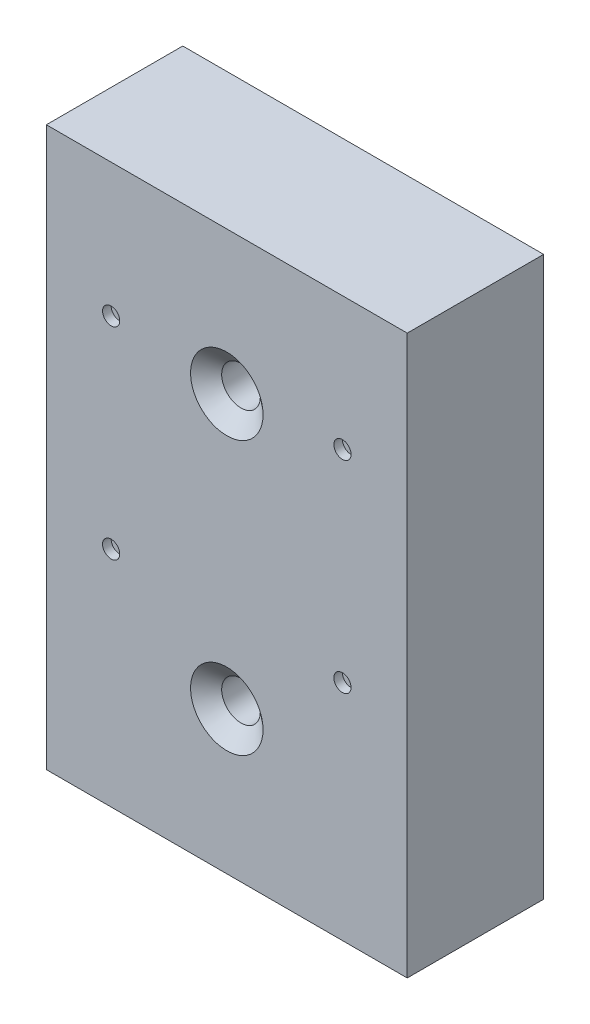
ISO-10303-21;
HEADER;
FILE_DESCRIPTION(('STEP AP214'),'2;1');
FILE_NAME('part.step','',(''),(''),'','','');
FILE_SCHEMA(('AUTOMOTIVE_DESIGN { 1 0 10303 214 1 1 1 1 }'));
ENDSEC;
DATA;
#1=APPLICATION_CONTEXT('core data for automotive mechanical design processes');
#2=APPLICATION_PROTOCOL_DEFINITION('international standard','automotive_design',2000,#1);
#3=PRODUCT_CONTEXT('',#1,'mechanical');
#4=PRODUCT('Part','Part','',(#3));
#5=PRODUCT_RELATED_PRODUCT_CATEGORY('part','',(#4));
#6=PRODUCT_DEFINITION_FORMATION('','',#4);
#7=PRODUCT_DEFINITION_CONTEXT('part definition',#1,'design');
#8=PRODUCT_DEFINITION('design','',#6,#7);
#9=PRODUCT_DEFINITION_SHAPE('','',#8);
#10=(LENGTH_UNIT() NAMED_UNIT(*) SI_UNIT(.MILLI.,.METRE.));
#11=(NAMED_UNIT(*) PLANE_ANGLE_UNIT() SI_UNIT($,.RADIAN.));
#12=(NAMED_UNIT(*) SI_UNIT($,.STERADIAN.) SOLID_ANGLE_UNIT());
#13=UNCERTAINTY_MEASURE_WITH_UNIT(LENGTH_MEASURE(1.E-05),#10,'distance_accuracy_value','');
#14=(GEOMETRIC_REPRESENTATION_CONTEXT(3) GLOBAL_UNCERTAINTY_ASSIGNED_CONTEXT((#13)) GLOBAL_UNIT_ASSIGNED_CONTEXT((#10,
#11,#12)) REPRESENTATION_CONTEXT('',''));
#15=CARTESIAN_POINT('',(0.,0.,0.));
#16=DIRECTION('',(0.,0.,1.));
#17=DIRECTION('',(1.,0.,0.));
#18=AXIS2_PLACEMENT_3D('',#15,#16,#17);
#19=CARTESIAN_POINT('',(21.,32.4999999999999,15.874999999999));
#20=DIRECTION('',(-1.,0.,0.));
#21=DIRECTION('',(0.,-1.,0.));
#22=AXIS2_PLACEMENT_3D('',#19,#20,#21);
#23=PLANE('',#22);
#24=DIRECTION('',(0.,1.,0.));
#25=VECTOR('',#24,1.);
#26=CARTESIAN_POINT('',(21.,32.5,-1.0547118733939E-12));
#27=LINE('',#26,#25);
#28=CARTESIAN_POINT('',(20.9999999999999,-32.5,-2.77555756156289E-13));
#29=VERTEX_POINT('',#28);
#30=CARTESIAN_POINT('',(21.,32.5,-1.0547118733939E-12));
#31=VERTEX_POINT('',#30);
#32=EDGE_CURVE('E100',#29,#31,#27,.T.);
#33=ORIENTED_EDGE('',*,*,#32,.T.);
#34=DIRECTION('',(0.,0.,-1.));
#35=VECTOR('',#34,1.);
#36=CARTESIAN_POINT('',(21.,32.4999999999999,15.874999999999));
#37=LINE('',#36,#35);
#38=CARTESIAN_POINT('',(21.,32.4999999999999,15.874999999999));
#39=VERTEX_POINT('',#38);
#40=EDGE_CURVE('E11',#39,#31,#37,.T.);
#41=ORIENTED_EDGE('',*,*,#40,.F.);
#42=DIRECTION('',(0.,1.,0.));
#43=VECTOR('',#42,1.);
#44=CARTESIAN_POINT('',(21.,32.4999999999999,15.874999999999));
#45=LINE('',#44,#43);
#46=CARTESIAN_POINT('',(20.9999999999999,-32.4999999999996,15.874999999999));
#47=VERTEX_POINT('',#46);
#48=EDGE_CURVE('E87',#47,#39,#45,.T.);
#49=ORIENTED_EDGE('',*,*,#48,.F.);
#50=DIRECTION('',(0.,0.,-1.));
#51=VECTOR('',#50,1.);
#52=CARTESIAN_POINT('',(20.9999999999999,-32.4999999999996,15.874999999999));
#53=LINE('',#52,#51);
#54=EDGE_CURVE('E96',#47,#29,#53,.T.);
#55=ORIENTED_EDGE('',*,*,#54,.T.);
#56=EDGE_LOOP('',(#33,#41,#49,#55));
#57=FACE_BOUND('',#56,.T.);
#58=ADVANCED_FACE('F34',(#57),#23,.F.);
#59=CARTESIAN_POINT('',(-21.,32.4999999999999,15.8749999999994));
#60=DIRECTION('',(0.,-1.,0.));
#61=DIRECTION('',(0.,0.,-1.));
#62=AXIS2_PLACEMENT_3D('',#59,#60,#61);
#63=PLANE('',#62);
#64=DIRECTION('',(-1.,0.,0.));
#65=VECTOR('',#64,1.);
#66=CARTESIAN_POINT('',(-21.,32.4999999999998,-1.0547118733939E-12));
#67=LINE('',#66,#65);
#68=CARTESIAN_POINT('',(-21.,32.4999999999998,-1.0547118733939E-12));
#69=VERTEX_POINT('',#68);
#70=EDGE_CURVE('E91',#31,#69,#67,.T.);
#71=ORIENTED_EDGE('',*,*,#70,.T.);
#72=DIRECTION('',(0.,0.,-1.));
#73=VECTOR('',#72,1.);
#74=CARTESIAN_POINT('',(-21.,32.4999999999999,15.8749999999994));
#75=LINE('',#74,#73);
#76=CARTESIAN_POINT('',(-21.,32.4999999999999,15.8749999999994));
#77=VERTEX_POINT('',#76);
#78=EDGE_CURVE('E43',#77,#69,#75,.T.);
#79=ORIENTED_EDGE('',*,*,#78,.F.);
#80=DIRECTION('',(-1.,0.,0.));
#81=VECTOR('',#80,1.);
#82=CARTESIAN_POINT('',(-21.,32.4999999999999,15.8749999999994));
#83=LINE('',#82,#81);
#84=EDGE_CURVE('E82',#39,#77,#83,.T.);
#85=ORIENTED_EDGE('',*,*,#84,.F.);
#86=ORIENTED_EDGE('',*,*,#40,.T.);
#87=EDGE_LOOP('',(#71,#79,#85,#86));
#88=FACE_BOUND('',#87,.T.);
#89=ADVANCED_FACE('F90',(#88),#63,.F.);
#90=CARTESIAN_POINT('',(-21.,32.4999999999999,15.8749999999994));
#91=DIRECTION('',(1.,0.,0.));
#92=DIRECTION('',(0.,1.,0.));
#93=AXIS2_PLACEMENT_3D('',#90,#91,#92);
#94=PLANE('',#93);
#95=DIRECTION('',(0.,-1.,0.));
#96=VECTOR('',#95,1.);
#97=CARTESIAN_POINT('',(-21.,32.4999999999998,-1.0547118733939E-12));
#98=LINE('',#97,#96);
#99=CARTESIAN_POINT('',(-21.0000000000002,-32.5,-2.77555756156289E-13));
#100=VERTEX_POINT('',#99);
#101=EDGE_CURVE('E69',#69,#100,#98,.T.);
#102=ORIENTED_EDGE('',*,*,#101,.T.);
#103=DIRECTION('',(0.,0.,-1.));
#104=VECTOR('',#103,1.);
#105=CARTESIAN_POINT('',(-21.0000000000002,-32.4999999999996,15.8749999999998));
#106=LINE('',#105,#104);
#107=CARTESIAN_POINT('',(-21.0000000000002,-32.4999999999996,15.8749999999998));
#108=VERTEX_POINT('',#107);
#109=EDGE_CURVE('E92',#108,#100,#106,.T.);
#110=ORIENTED_EDGE('',*,*,#109,.F.);
#111=DIRECTION('',(0.,-1.,0.));
#112=VECTOR('',#111,1.);
#113=CARTESIAN_POINT('',(-21.,32.4999999999999,15.8749999999994));
#114=LINE('',#113,#112);
#115=EDGE_CURVE('E85',#77,#108,#114,.T.);
#116=ORIENTED_EDGE('',*,*,#115,.F.);
#117=ORIENTED_EDGE('',*,*,#78,.T.);
#118=EDGE_LOOP('',(#102,#110,#116,#117));
#119=FACE_BOUND('',#118,.T.);
#120=ADVANCED_FACE('F94',(#119),#94,.F.);
#121=CARTESIAN_POINT('',(-21.0000000000002,-32.4999999999996,15.8749999999998));
#122=DIRECTION('',(0.,1.,0.));
#123=DIRECTION('',(0.,0.,1.));
#124=AXIS2_PLACEMENT_3D('',#121,#122,#123);
#125=PLANE('',#124);
#126=DIRECTION('',(1.,0.,0.));
#127=VECTOR('',#126,1.);
#128=CARTESIAN_POINT('',(-21.0000000000002,-32.5,-2.77555756156289E-13));
#129=LINE('',#128,#127);
#130=EDGE_CURVE('E75',#100,#29,#129,.T.);
#131=ORIENTED_EDGE('',*,*,#130,.T.);
#132=ORIENTED_EDGE('',*,*,#54,.F.);
#133=DIRECTION('',(1.,0.,0.));
#134=VECTOR('',#133,1.);
#135=CARTESIAN_POINT('',(-21.0000000000002,-32.4999999999996,15.8749999999998));
#136=LINE('',#135,#134);
#137=EDGE_CURVE('E52',#108,#47,#136,.T.);
#138=ORIENTED_EDGE('',*,*,#137,.F.);
#139=ORIENTED_EDGE('',*,*,#109,.T.);
#140=EDGE_LOOP('',(#131,#132,#138,#139));
#141=FACE_BOUND('',#140,.T.);
#142=ADVANCED_FACE('F170',(#141),#125,.F.);
#143=CARTESIAN_POINT('',(0.,3.33066907387547E-13,15.8750000000001));
#144=DIRECTION('',(0.,0.,1.));
#145=DIRECTION('',(1.,0.,0.));
#146=AXIS2_PLACEMENT_3D('',#143,#144,#145);
#147=PLANE('',#146);
#148=CARTESIAN_POINT('',(0.,15.8749999999999,15.8749999999992));
#149=DIRECTION('',(0.,0.,1.));
#150=DIRECTION('',(1.,0.,0.));
#151=AXIS2_PLACEMENT_3D('',#148,#149,#150);
#152=CIRCLE('',#151,4.2164);
#153=CARTESIAN_POINT('',(4.21639999999996,15.8749999999999,15.8749999999992));
#154=VERTEX_POINT('',#153);
#155=EDGE_CURVE('E161',#154,#154,#152,.T.);
#156=ORIENTED_EDGE('',*,*,#155,.F.);
#157=EDGE_LOOP('',(#156));
#158=FACE_BOUND('',#157,.T.);
#159=CARTESIAN_POINT('',(0.,-15.8749999999998,15.8750000000001));
#160=DIRECTION('',(0.,0.,1.));
#161=DIRECTION('',(1.,0.,0.));
#162=AXIS2_PLACEMENT_3D('',#159,#160,#161);
#163=CIRCLE('',#162,4.2164);
#164=CARTESIAN_POINT('',(4.21639999999995,-15.8749999999998,15.8750000000001));
#165=VERTEX_POINT('',#164);
#166=EDGE_CURVE('E152',#165,#165,#163,.T.);
#167=ORIENTED_EDGE('',*,*,#166,.F.);
#168=EDGE_LOOP('',(#167));
#169=FACE_BOUND('',#168,.T.);
#170=CARTESIAN_POINT('',(13.4595397764349,-6.49999999999962,15.8749999999997));
#171=DIRECTION('',(0.,0.,1.));
#172=DIRECTION('',(1.,0.,0.));
#173=AXIS2_PLACEMENT_3D('',#170,#171,#172);
#174=CIRCLE('',#173,1.);
#175=CARTESIAN_POINT('',(14.4595397764349,-6.49999999999962,15.8749999999997));
#176=VERTEX_POINT('',#175);
#177=EDGE_CURVE('E37',#176,#176,#174,.F.);
#178=ORIENTED_EDGE('',*,*,#177,.T.);
#179=EDGE_LOOP('',(#178));
#180=FACE_BOUND('',#179,.T.);
#181=CARTESIAN_POINT('',(13.4595397764349,16.9999999999998,15.8749999999995));
#182=DIRECTION('',(0.,0.,1.));
#183=DIRECTION('',(1.,0.,0.));
#184=AXIS2_PLACEMENT_3D('',#181,#182,#183);
#185=CIRCLE('',#184,1.);
#186=CARTESIAN_POINT('',(14.4595397764349,16.9999999999998,15.8749999999995));
#187=VERTEX_POINT('',#186);
#188=EDGE_CURVE('E114',#187,#187,#185,.F.);
#189=ORIENTED_EDGE('',*,*,#188,.T.);
#190=EDGE_LOOP('',(#189));
#191=FACE_BOUND('',#190,.T.);
#192=CARTESIAN_POINT('',(-13.4595397764349,16.9999999999998,15.8749999999995));
#193=DIRECTION('',(0.,0.,1.));
#194=DIRECTION('',(1.,0.,0.));
#195=AXIS2_PLACEMENT_3D('',#192,#193,#194);
#196=CIRCLE('',#195,1.);
#197=CARTESIAN_POINT('',(-12.4595397764349,16.9999999999998,15.8749999999995));
#198=VERTEX_POINT('',#197);
#199=EDGE_CURVE('E111',#198,#198,#196,.F.);
#200=ORIENTED_EDGE('',*,*,#199,.T.);
#201=EDGE_LOOP('',(#200));
#202=FACE_BOUND('',#201,.T.);
#203=CARTESIAN_POINT('',(-13.4595397764349,-6.49999999999962,15.8749999999997));
#204=DIRECTION('',(0.,0.,1.));
#205=DIRECTION('',(1.,0.,0.));
#206=AXIS2_PLACEMENT_3D('',#203,#204,#205);
#207=CIRCLE('',#206,1.);
#208=CARTESIAN_POINT('',(-12.4595397764349,-6.49999999999962,15.8749999999997));
#209=VERTEX_POINT('',#208);
#210=EDGE_CURVE('E108',#209,#209,#207,.F.);
#211=ORIENTED_EDGE('',*,*,#210,.T.);
#212=EDGE_LOOP('',(#211));
#213=FACE_BOUND('',#212,.T.);
#214=ORIENTED_EDGE('',*,*,#48,.T.);
#215=ORIENTED_EDGE('',*,*,#84,.T.);
#216=ORIENTED_EDGE('',*,*,#115,.T.);
#217=ORIENTED_EDGE('',*,*,#137,.T.);
#218=EDGE_LOOP('',(#214,#215,#216,#217));
#219=FACE_BOUND('',#218,.T.);
#220=ADVANCED_FACE('F83',(#158,#169,#180,#191,#202,#213,#219),#147,.T.);
#221=CARTESIAN_POINT('',(0.,0.,0.));
#222=DIRECTION('',(0.,0.,1.));
#223=DIRECTION('',(1.,0.,0.));
#224=AXIS2_PLACEMENT_3D('',#221,#222,#223);
#225=PLANE('',#224);
#226=CARTESIAN_POINT('',(0.,15.8750000000001,-1.11022302462516E-12));
#227=DIRECTION('',(0.,0.,1.));
#228=DIRECTION('',(1.,0.,0.));
#229=AXIS2_PLACEMENT_3D('',#226,#227,#228);
#230=CIRCLE('',#229,2.2479);
#231=CARTESIAN_POINT('',(2.2479,15.8750000000001,-1.11010427458769E-12));
#232=VERTEX_POINT('',#231);
#233=EDGE_CURVE('E155',#232,#232,#230,.T.);
#234=ORIENTED_EDGE('',*,*,#233,.T.);
#235=EDGE_LOOP('',(#234));
#236=FACE_BOUND('',#235,.T.);
#237=CARTESIAN_POINT('',(0.,-15.8750000000001,-2.22044604925031E-13));
#238=DIRECTION('',(0.,0.,1.));
#239=DIRECTION('',(1.,0.,0.));
#240=AXIS2_PLACEMENT_3D('',#237,#238,#239);
#241=CIRCLE('',#240,2.2479);
#242=CARTESIAN_POINT('',(2.24789999999999,-15.8750000000001,-2.21925854887567E-13));
#243=VERTEX_POINT('',#242);
#244=EDGE_CURVE('E133',#243,#243,#241,.T.);
#245=ORIENTED_EDGE('',*,*,#244,.T.);
#246=EDGE_LOOP('',(#245));
#247=FACE_BOUND('',#246,.T.);
#248=ORIENTED_EDGE('',*,*,#32,.F.);
#249=ORIENTED_EDGE('',*,*,#130,.F.);
#250=ORIENTED_EDGE('',*,*,#101,.F.);
#251=ORIENTED_EDGE('',*,*,#70,.F.);
#252=EDGE_LOOP('',(#248,#249,#250,#251));
#253=FACE_BOUND('',#252,.T.);
#254=ADVANCED_FACE('F169',(#236,#247,#253),#225,.F.);
#255=CARTESIAN_POINT('',(-13.4595397764349,-6.49999999999962,15.8750119999996));
#256=DIRECTION('',(0.,0.,-1.));
#257=DIRECTION('',(-1.,0.,0.));
#258=AXIS2_PLACEMENT_3D('',#255,#256,#257);
#259=CYLINDRICAL_SURFACE('',#258,1.);
#260=ORIENTED_EDGE('',*,*,#210,.F.);
#261=EDGE_LOOP('',(#260));
#262=FACE_BOUND('',#261,.T.);
#263=CARTESIAN_POINT('',(-13.4595397764349,-6.49999999999978,14.8749999999996));
#264=DIRECTION('',(0.,0.,1.));
#265=DIRECTION('',(1.,0.,0.));
#266=AXIS2_PLACEMENT_3D('',#263,#264,#265);
#267=CIRCLE('',#266,1.);
#268=CARTESIAN_POINT('',(-12.4595397764349,-6.49999999999978,14.8749999999996));
#269=VERTEX_POINT('',#268);
#270=EDGE_CURVE('E112',#269,#269,#267,.T.);
#271=ORIENTED_EDGE('',*,*,#270,.F.);
#272=EDGE_LOOP('',(#271));
#273=FACE_BOUND('',#272,.T.);
#274=ADVANCED_FACE('F197',(#262,#273),#259,.F.);
#275=CARTESIAN_POINT('',(-13.4595397764349,-6.49999999999978,14.8749999999996));
#276=DIRECTION('',(0.,0.,1.));
#277=DIRECTION('',(1.,0.,0.));
#278=AXIS2_PLACEMENT_3D('',#275,#276,#277);
#279=PLANE('',#278);
#280=ORIENTED_EDGE('',*,*,#270,.T.);
#281=EDGE_LOOP('',(#280));
#282=FACE_BOUND('',#281,.T.);
#283=ADVANCED_FACE('F203',(#282),#279,.T.);
#284=CARTESIAN_POINT('',(-13.4595397764349,16.9999999999998,15.8750119999994));
#285=DIRECTION('',(0.,0.,-1.));
#286=DIRECTION('',(-1.,0.,0.));
#287=AXIS2_PLACEMENT_3D('',#284,#285,#286);
#288=CYLINDRICAL_SURFACE('',#287,1.);
#289=ORIENTED_EDGE('',*,*,#199,.F.);
#290=EDGE_LOOP('',(#289));
#291=FACE_BOUND('',#290,.T.);
#292=CARTESIAN_POINT('',(-13.4595397764349,16.9999999999999,14.8749999999994));
#293=DIRECTION('',(0.,0.,1.));
#294=DIRECTION('',(1.,0.,0.));
#295=AXIS2_PLACEMENT_3D('',#292,#293,#294);
#296=CIRCLE('',#295,1.);
#297=CARTESIAN_POINT('',(-12.4595397764349,16.9999999999999,14.8749999999994));
#298=VERTEX_POINT('',#297);
#299=EDGE_CURVE('E136',#298,#298,#296,.T.);
#300=ORIENTED_EDGE('',*,*,#299,.F.);
#301=EDGE_LOOP('',(#300));
#302=FACE_BOUND('',#301,.T.);
#303=ADVANCED_FACE('F242',(#291,#302),#288,.F.);
#304=CARTESIAN_POINT('',(-13.4595397764349,16.9999999999999,14.8749999999994));
#305=DIRECTION('',(0.,0.,1.));
#306=DIRECTION('',(1.,0.,0.));
#307=AXIS2_PLACEMENT_3D('',#304,#305,#306);
#308=PLANE('',#307);
#309=ORIENTED_EDGE('',*,*,#299,.T.);
#310=EDGE_LOOP('',(#309));
#311=FACE_BOUND('',#310,.T.);
#312=ADVANCED_FACE('F251',(#311),#308,.T.);
#313=CARTESIAN_POINT('',(13.4595397764349,16.9999999999998,15.8750119999994));
#314=DIRECTION('',(0.,0.,-1.));
#315=DIRECTION('',(-1.,0.,0.));
#316=AXIS2_PLACEMENT_3D('',#313,#314,#315);
#317=CYLINDRICAL_SURFACE('',#316,1.);
#318=ORIENTED_EDGE('',*,*,#188,.F.);
#319=EDGE_LOOP('',(#318));
#320=FACE_BOUND('',#319,.T.);
#321=CARTESIAN_POINT('',(13.4595397764349,16.9999999999999,14.8749999999994));
#322=DIRECTION('',(0.,0.,1.));
#323=DIRECTION('',(1.,0.,0.));
#324=AXIS2_PLACEMENT_3D('',#321,#322,#323);
#325=CIRCLE('',#324,1.);
#326=CARTESIAN_POINT('',(14.4595397764349,16.9999999999999,14.8749999999994));
#327=VERTEX_POINT('',#326);
#328=EDGE_CURVE('E132',#327,#327,#325,.T.);
#329=ORIENTED_EDGE('',*,*,#328,.F.);
#330=EDGE_LOOP('',(#329));
#331=FACE_BOUND('',#330,.T.);
#332=ADVANCED_FACE('F261',(#320,#331),#317,.F.);
#333=CARTESIAN_POINT('',(13.4595397764349,16.9999999999999,14.8749999999994));
#334=DIRECTION('',(0.,0.,1.));
#335=DIRECTION('',(1.,0.,0.));
#336=AXIS2_PLACEMENT_3D('',#333,#334,#335);
#337=PLANE('',#336);
#338=ORIENTED_EDGE('',*,*,#328,.T.);
#339=EDGE_LOOP('',(#338));
#340=FACE_BOUND('',#339,.T.);
#341=ADVANCED_FACE('F126',(#340),#337,.T.);
#342=CARTESIAN_POINT('',(13.4595397764349,-6.49999999999962,15.8750119999996));
#343=DIRECTION('',(0.,0.,-1.));
#344=DIRECTION('',(-1.,0.,0.));
#345=AXIS2_PLACEMENT_3D('',#342,#343,#344);
#346=CYLINDRICAL_SURFACE('',#345,1.);
#347=ORIENTED_EDGE('',*,*,#177,.F.);
#348=EDGE_LOOP('',(#347));
#349=FACE_BOUND('',#348,.T.);
#350=CARTESIAN_POINT('',(13.4595397764349,-6.49999999999984,14.8749999999996));
#351=DIRECTION('',(0.,0.,1.));
#352=DIRECTION('',(1.,0.,0.));
#353=AXIS2_PLACEMENT_3D('',#350,#351,#352);
#354=CIRCLE('',#353,1.);
#355=CARTESIAN_POINT('',(14.4595397764349,-6.49999999999984,14.8749999999996));
#356=VERTEX_POINT('',#355);
#357=EDGE_CURVE('E130',#356,#356,#354,.T.);
#358=ORIENTED_EDGE('',*,*,#357,.F.);
#359=EDGE_LOOP('',(#358));
#360=FACE_BOUND('',#359,.T.);
#361=ADVANCED_FACE('F122',(#349,#360),#346,.F.);
#362=CARTESIAN_POINT('',(13.4595397764349,-6.49999999999984,14.8749999999996));
#363=DIRECTION('',(0.,0.,1.));
#364=DIRECTION('',(1.,0.,0.));
#365=AXIS2_PLACEMENT_3D('',#362,#363,#364);
#366=PLANE('',#365);
#367=ORIENTED_EDGE('',*,*,#357,.T.);
#368=EDGE_LOOP('',(#367));
#369=FACE_BOUND('',#368,.T.);
#370=ADVANCED_FACE('F125',(#369),#366,.T.);
#371=CARTESIAN_POINT('',(0.,-15.8749999999998,15.8750000000001));
#372=DIRECTION('',(0.,0.,1.));
#373=DIRECTION('',(1.,0.,0.));
#374=AXIS2_PLACEMENT_3D('',#371,#372,#373);
#375=CYLINDRICAL_SURFACE('',#374,2.2479);
#376=ORIENTED_EDGE('',*,*,#244,.F.);
#377=EDGE_LOOP('',(#376));
#378=FACE_BOUND('',#377,.T.);
#379=CARTESIAN_POINT('',(0.,-15.8750000000004,14.2232323760276));
#380=DIRECTION('',(0.,0.,1.));
#381=DIRECTION('',(1.,0.,0.));
#382=AXIS2_PLACEMENT_3D('',#379,#380,#381);
#383=CIRCLE('',#382,2.2479);
#384=CARTESIAN_POINT('',(2.24789999999995,-15.8750000000004,14.2232323760276));
#385=VERTEX_POINT('',#384);
#386=EDGE_CURVE('E139',#385,#385,#383,.T.);
#387=ORIENTED_EDGE('',*,*,#386,.T.);
#388=EDGE_LOOP('',(#387));
#389=FACE_BOUND('',#388,.T.);
#390=ADVANCED_FACE('F177',(#378,#389),#375,.F.);
#391=CARTESIAN_POINT('',(0.,-15.8749999999998,15.8750000000001));
#392=DIRECTION('',(0.,0.,1.));
#393=DIRECTION('',(1.,0.,0.));
#394=AXIS2_PLACEMENT_3D('',#391,#392,#393);
#395=CONICAL_SURFACE('',#394,4.2164,0.872664625997165);
#396=ORIENTED_EDGE('',*,*,#386,.F.);
#397=EDGE_LOOP('',(#396));
#398=FACE_BOUND('',#397,.T.);
#399=ORIENTED_EDGE('',*,*,#166,.T.);
#400=EDGE_LOOP('',(#399));
#401=FACE_BOUND('',#400,.T.);
#402=ADVANCED_FACE('F174',(#398,#401),#395,.F.);
#403=CARTESIAN_POINT('',(0.,15.8749999999999,15.8749999999992));
#404=DIRECTION('',(0.,0.,1.));
#405=DIRECTION('',(1.,0.,0.));
#406=AXIS2_PLACEMENT_3D('',#403,#404,#405);
#407=CYLINDRICAL_SURFACE('',#406,2.2479);
#408=ORIENTED_EDGE('',*,*,#233,.F.);
#409=EDGE_LOOP('',(#408));
#410=FACE_BOUND('',#409,.T.);
#411=CARTESIAN_POINT('',(0.,15.8750000000002,14.2232323760267));
#412=DIRECTION('',(0.,0.,1.));
#413=DIRECTION('',(1.,0.,0.));
#414=AXIS2_PLACEMENT_3D('',#411,#412,#413);
#415=CIRCLE('',#414,2.2479);
#416=CARTESIAN_POINT('',(2.24789999999996,15.8750000000002,14.2232323760267));
#417=VERTEX_POINT('',#416);
#418=EDGE_CURVE('E158',#417,#417,#415,.T.);
#419=ORIENTED_EDGE('',*,*,#418,.T.);
#420=EDGE_LOOP('',(#419));
#421=FACE_BOUND('',#420,.T.);
#422=ADVANCED_FACE('F176',(#410,#421),#407,.F.);
#423=CARTESIAN_POINT('',(0.,15.8749999999999,15.8749999999992));
#424=DIRECTION('',(0.,0.,1.));
#425=DIRECTION('',(1.,0.,0.));
#426=AXIS2_PLACEMENT_3D('',#423,#424,#425);
#427=CONICAL_SURFACE('',#426,4.2164,0.872664625997165);
#428=ORIENTED_EDGE('',*,*,#418,.F.);
#429=EDGE_LOOP('',(#428));
#430=FACE_BOUND('',#429,.T.);
#431=ORIENTED_EDGE('',*,*,#155,.T.);
#432=EDGE_LOOP('',(#431));
#433=FACE_BOUND('',#432,.T.);
#434=ADVANCED_FACE('F165',(#430,#433),#427,.F.);
#435=CLOSED_SHELL('',(#58,#89,#120,#142,#220,#254,#274,#283,#303,#312,#332,#341,#361,#370,#390,
#402,#422,#434));
#436=MANIFOLD_SOLID_BREP('B2',#435);
#437=ADVANCED_BREP_SHAPE_REPRESENTATION('',(#18,#436),#14);
#438=SHAPE_DEFINITION_REPRESENTATION(#9,#437);
ENDSEC;
END-ISO-10303-21;
